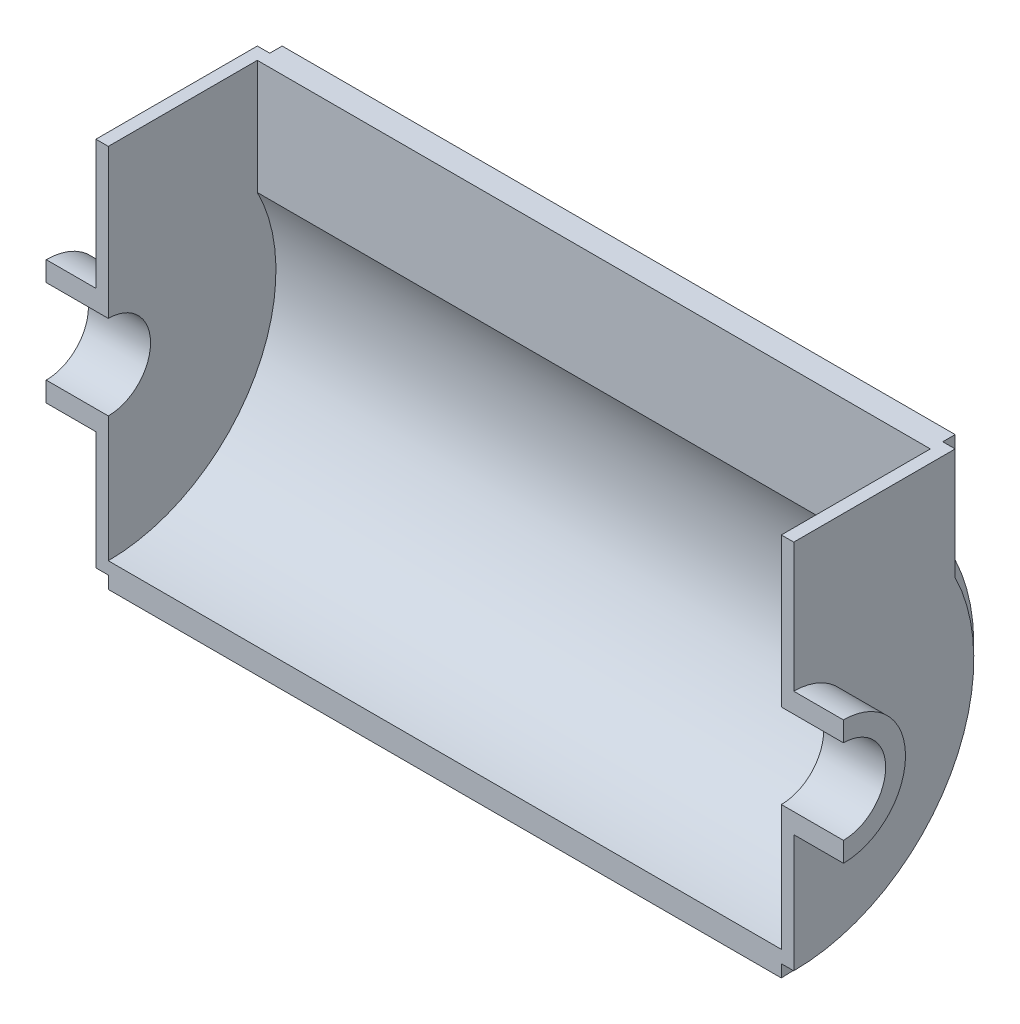
ISO-10303-21;
HEADER;
FILE_DESCRIPTION(('STEP AP214'),'2;1');
FILE_NAME('part.step','',(''),(''),'','','');
FILE_SCHEMA(('AUTOMOTIVE_DESIGN { 1 0 10303 214 1 1 1 1 }'));
ENDSEC;
DATA;
#1=APPLICATION_CONTEXT('core data for automotive mechanical design processes');
#2=APPLICATION_PROTOCOL_DEFINITION('international standard','automotive_design',2000,#1);
#3=PRODUCT_CONTEXT('',#1,'mechanical');
#4=PRODUCT('Part','Part','',(#3));
#5=PRODUCT_RELATED_PRODUCT_CATEGORY('part','',(#4));
#6=PRODUCT_DEFINITION_FORMATION('','',#4);
#7=PRODUCT_DEFINITION_CONTEXT('part definition',#1,'design');
#8=PRODUCT_DEFINITION('design','',#6,#7);
#9=PRODUCT_DEFINITION_SHAPE('','',#8);
#10=(LENGTH_UNIT() NAMED_UNIT(*) SI_UNIT(.MILLI.,.METRE.));
#11=(NAMED_UNIT(*) PLANE_ANGLE_UNIT() SI_UNIT($,.RADIAN.));
#12=(NAMED_UNIT(*) SI_UNIT($,.STERADIAN.) SOLID_ANGLE_UNIT());
#13=UNCERTAINTY_MEASURE_WITH_UNIT(LENGTH_MEASURE(1.E-05),#10,'distance_accuracy_value','');
#14=(GEOMETRIC_REPRESENTATION_CONTEXT(3) GLOBAL_UNCERTAINTY_ASSIGNED_CONTEXT((#13)) GLOBAL_UNIT_ASSIGNED_CONTEXT((#10,
#11,#12)) REPRESENTATION_CONTEXT('',''));
#15=CARTESIAN_POINT('',(0.,0.,0.));
#16=DIRECTION('',(0.,0.,1.));
#17=DIRECTION('',(1.,0.,0.));
#18=AXIS2_PLACEMENT_3D('',#15,#16,#17);
#19=CARTESIAN_POINT('',(25.,0.,0.));
#20=DIRECTION('',(1.,0.,0.));
#21=DIRECTION('',(0.,0.,-1.));
#22=AXIS2_PLACEMENT_3D('',#19,#20,#21);
#23=PLANE('',#22);
#24=DIRECTION('',(0.,-1.,0.));
#25=VECTOR('',#24,1.);
#26=CARTESIAN_POINT('',(25.,-17.,-1.78065548281E-13));
#27=LINE('',#26,#25);
#28=CARTESIAN_POINT('',(25.,-17.,-1.78065548281E-13));
#29=VERTEX_POINT('',#28);
#30=CARTESIAN_POINT('',(25.,-67.5,0.));
#31=VERTEX_POINT('',#30);
#32=EDGE_CURVE('E315',#29,#31,#27,.T.);
#33=ORIENTED_EDGE('',*,*,#32,.T.);
#34=CARTESIAN_POINT('',(25.,0.,0.));
#35=DIRECTION('',(1.,0.,0.));
#36=DIRECTION('',(0.,0.,-1.));
#37=AXIS2_PLACEMENT_3D('',#34,#35,#36);
#38=CIRCLE('',#37,67.5);
#39=CARTESIAN_POINT('',(25.,30.9232921921324,-60.));
#40=VERTEX_POINT('',#39);
#41=EDGE_CURVE('E283',#31,#40,#38,.T.);
#42=ORIENTED_EDGE('',*,*,#41,.T.);
#43=DIRECTION('',(0.,1.,0.));
#44=VECTOR('',#43,1.);
#45=CARTESIAN_POINT('',(25.,30.9232921921324,-60.));
#46=LINE('',#45,#44);
#47=CARTESIAN_POINT('',(25.,77.,-60.));
#48=VERTEX_POINT('',#47);
#49=EDGE_CURVE('E280',#40,#48,#46,.T.);
#50=ORIENTED_EDGE('',*,*,#49,.T.);
#51=DIRECTION('',(0.,0.,1.));
#52=VECTOR('',#51,1.);
#53=CARTESIAN_POINT('',(25.,77.,0.));
#54=LINE('',#53,#52);
#55=CARTESIAN_POINT('',(25.,77.,0.));
#56=VERTEX_POINT('',#55);
#57=EDGE_CURVE('E307',#48,#56,#54,.T.);
#58=ORIENTED_EDGE('',*,*,#57,.T.);
#59=DIRECTION('',(0.,-1.,0.));
#60=VECTOR('',#59,1.);
#61=CARTESIAN_POINT('',(25.,17.,0.));
#62=LINE('',#61,#60);
#63=CARTESIAN_POINT('',(25.,17.,0.));
#64=VERTEX_POINT('',#63);
#65=EDGE_CURVE('E309',#56,#64,#62,.T.);
#66=ORIENTED_EDGE('',*,*,#65,.T.);
#67=CARTESIAN_POINT('',(25.,0.,0.));
#68=DIRECTION('',(-1.,0.,0.));
#69=DIRECTION('',(0.,0.,-1.));
#70=AXIS2_PLACEMENT_3D('',#67,#68,#69);
#71=CIRCLE('',#70,17.);
#72=EDGE_CURVE('E312',#64,#29,#71,.T.);
#73=ORIENTED_EDGE('',*,*,#72,.T.);
#74=EDGE_LOOP('',(#33,#42,#50,#58,#66,#73));
#75=FACE_BOUND('',#74,.T.);
#76=ADVANCED_FACE('F38',(#75),#23,.T.);
#77=CARTESIAN_POINT('',(20.,0.,0.));
#78=DIRECTION('',(-1.,0.,0.));
#79=DIRECTION('',(0.,0.,1.));
#80=AXIS2_PLACEMENT_3D('',#77,#78,#79);
#81=CYLINDRICAL_SURFACE('',#80,25.);
#82=CARTESIAN_POINT('',(0.,0.,0.));
#83=DIRECTION('',(1.,0.,0.));
#84=DIRECTION('',(0.,0.,-1.));
#85=AXIS2_PLACEMENT_3D('',#82,#83,#84);
#86=CIRCLE('',#85,25.);
#87=CARTESIAN_POINT('',(0.,-25.,0.));
#88=VERTEX_POINT('',#87);
#89=CARTESIAN_POINT('',(0.,25.,0.));
#90=VERTEX_POINT('',#89);
#91=EDGE_CURVE('E340',#88,#90,#86,.T.);
#92=ORIENTED_EDGE('',*,*,#91,.T.);
#93=DIRECTION('',(-1.,0.,0.));
#94=VECTOR('',#93,1.);
#95=CARTESIAN_POINT('',(20.,25.,0.));
#96=LINE('',#95,#94);
#97=CARTESIAN_POINT('',(20.,25.,0.));
#98=VERTEX_POINT('',#97);
#99=EDGE_CURVE('E11',#98,#90,#96,.T.);
#100=ORIENTED_EDGE('',*,*,#99,.F.);
#101=CARTESIAN_POINT('',(20.,0.,0.));
#102=DIRECTION('',(1.,0.,0.));
#103=DIRECTION('',(0.,0.,-1.));
#104=AXIS2_PLACEMENT_3D('',#101,#102,#103);
#105=CIRCLE('',#104,25.);
#106=CARTESIAN_POINT('',(20.,-25.,0.));
#107=VERTEX_POINT('',#106);
#108=EDGE_CURVE('E341',#107,#98,#105,.T.);
#109=ORIENTED_EDGE('',*,*,#108,.F.);
#110=DIRECTION('',(-1.,0.,0.));
#111=VECTOR('',#110,1.);
#112=CARTESIAN_POINT('',(20.,-25.,0.));
#113=LINE('',#112,#111);
#114=EDGE_CURVE('E344',#107,#88,#113,.T.);
#115=ORIENTED_EDGE('',*,*,#114,.T.);
#116=EDGE_LOOP('',(#92,#100,#109,#115));
#117=FACE_BOUND('',#116,.T.);
#118=ADVANCED_FACE('F40',(#117),#81,.T.);
#119=CARTESIAN_POINT('',(20.,25.,0.));
#120=DIRECTION('',(0.,0.,-1.));
#121=DIRECTION('',(-1.,0.,0.));
#122=AXIS2_PLACEMENT_3D('',#119,#120,#121);
#123=PLANE('',#122);
#124=DIRECTION('',(0.,-1.,0.));
#125=VECTOR('',#124,1.);
#126=CARTESIAN_POINT('',(0.,25.,0.));
#127=LINE('',#126,#125);
#128=CARTESIAN_POINT('',(0.,17.,0.));
#129=VERTEX_POINT('',#128);
#130=EDGE_CURVE('E348',#90,#129,#127,.T.);
#131=ORIENTED_EDGE('',*,*,#130,.T.);
#132=DIRECTION('',(-1.,0.,0.));
#133=VECTOR('',#132,1.);
#134=CARTESIAN_POINT('',(20.,17.,0.));
#135=LINE('',#134,#133);
#136=EDGE_CURVE('E46',#64,#129,#135,.T.);
#137=ORIENTED_EDGE('',*,*,#136,.F.);
#138=ORIENTED_EDGE('',*,*,#65,.F.);
#139=DIRECTION('',(-1.,0.,0.));
#140=VECTOR('',#139,1.);
#141=CARTESIAN_POINT('',(25.,77.,0.));
#142=LINE('',#141,#140);
#143=CARTESIAN_POINT('',(20.,77.,0.));
#144=VERTEX_POINT('',#143);
#145=EDGE_CURVE('E331',#56,#144,#142,.T.);
#146=ORIENTED_EDGE('',*,*,#145,.T.);
#147=DIRECTION('',(0.,-1.,0.));
#148=VECTOR('',#147,1.);
#149=CARTESIAN_POINT('',(20.,17.,0.));
#150=LINE('',#149,#148);
#151=EDGE_CURVE('E325',#144,#98,#150,.T.);
#152=ORIENTED_EDGE('',*,*,#151,.T.);
#153=ORIENTED_EDGE('',*,*,#99,.T.);
#154=EDGE_LOOP('',(#131,#137,#138,#146,#152,#153));
#155=FACE_BOUND('',#154,.T.);
#156=ADVANCED_FACE('F394',(#155),#123,.F.);
#157=CARTESIAN_POINT('',(20.,0.,0.));
#158=DIRECTION('',(-1.,0.,0.));
#159=DIRECTION('',(0.,0.,1.));
#160=AXIS2_PLACEMENT_3D('',#157,#158,#159);
#161=CYLINDRICAL_SURFACE('',#160,17.);
#162=CARTESIAN_POINT('',(0.,0.,0.));
#163=DIRECTION('',(-1.,0.,0.));
#164=DIRECTION('',(0.,0.,-1.));
#165=AXIS2_PLACEMENT_3D('',#162,#163,#164);
#166=CIRCLE('',#165,17.);
#167=CARTESIAN_POINT('',(0.,-17.,0.));
#168=VERTEX_POINT('',#167);
#169=EDGE_CURVE('E350',#129,#168,#166,.T.);
#170=ORIENTED_EDGE('',*,*,#169,.T.);
#171=DIRECTION('',(-1.,0.,0.));
#172=VECTOR('',#171,1.);
#173=CARTESIAN_POINT('',(20.,-17.,0.));
#174=LINE('',#173,#172);
#175=EDGE_CURVE('E355',#29,#168,#174,.T.);
#176=ORIENTED_EDGE('',*,*,#175,.F.);
#177=ORIENTED_EDGE('',*,*,#72,.F.);
#178=ORIENTED_EDGE('',*,*,#136,.T.);
#179=EDGE_LOOP('',(#170,#176,#177,#178));
#180=FACE_BOUND('',#179,.T.);
#181=ADVANCED_FACE('F361',(#180),#161,.F.);
#182=CARTESIAN_POINT('',(20.,-17.,0.));
#183=DIRECTION('',(0.,0.,-1.));
#184=DIRECTION('',(-1.,0.,0.));
#185=AXIS2_PLACEMENT_3D('',#182,#183,#184);
#186=PLANE('',#185);
#187=DIRECTION('',(0.,-1.,0.));
#188=VECTOR('',#187,1.);
#189=CARTESIAN_POINT('',(0.,-17.,0.));
#190=LINE('',#189,#188);
#191=EDGE_CURVE('E345',#168,#88,#190,.T.);
#192=ORIENTED_EDGE('',*,*,#191,.T.);
#193=ORIENTED_EDGE('',*,*,#114,.F.);
#194=DIRECTION('',(0.,-1.,0.));
#195=VECTOR('',#194,1.);
#196=CARTESIAN_POINT('',(20.,-17.,-1.78065548281E-13));
#197=LINE('',#196,#195);
#198=CARTESIAN_POINT('',(20.,-72.5,0.));
#199=VERTEX_POINT('',#198);
#200=EDGE_CURVE('E305',#107,#199,#197,.T.);
#201=ORIENTED_EDGE('',*,*,#200,.T.);
#202=DIRECTION('',(-1.,0.,0.));
#203=VECTOR('',#202,1.);
#204=CARTESIAN_POINT('',(25.,-72.5,0.));
#205=LINE('',#204,#203);
#206=CARTESIAN_POINT('',(25.,-72.5,0.));
#207=VERTEX_POINT('',#206);
#208=EDGE_CURVE('E318',#207,#199,#205,.T.);
#209=ORIENTED_EDGE('',*,*,#208,.F.);
#210=DIRECTION('',(0.,1.,0.));
#211=VECTOR('',#210,1.);
#212=CARTESIAN_POINT('',(25.,-77.5,0.));
#213=LINE('',#212,#211);
#214=CARTESIAN_POINT('',(25.,-77.5,0.));
#215=VERTEX_POINT('',#214);
#216=EDGE_CURVE('E286',#215,#207,#213,.T.);
#217=ORIENTED_EDGE('',*,*,#216,.F.);
#218=DIRECTION('',(-1.,0.,0.));
#219=VECTOR('',#218,1.);
#220=CARTESIAN_POINT('',(296.,-77.5,0.));
#221=LINE('',#220,#219);
#222=CARTESIAN_POINT('',(296.,-77.5,0.));
#223=VERTEX_POINT('',#222);
#224=EDGE_CURVE('E291',#223,#215,#221,.T.);
#225=ORIENTED_EDGE('',*,*,#224,.F.);
#226=DIRECTION('',(0.,1.,0.));
#227=VECTOR('',#226,1.);
#228=CARTESIAN_POINT('',(296.,-77.5,0.));
#229=LINE('',#228,#227);
#230=CARTESIAN_POINT('',(296.,-72.5,0.));
#231=VERTEX_POINT('',#230);
#232=EDGE_CURVE('E271',#223,#231,#229,.T.);
#233=ORIENTED_EDGE('',*,*,#232,.T.);
#234=DIRECTION('',(1.,0.,0.));
#235=VECTOR('',#234,1.);
#236=CARTESIAN_POINT('',(296.,-72.5,0.));
#237=LINE('',#236,#235);
#238=CARTESIAN_POINT('',(301.,-72.5,0.));
#239=VERTEX_POINT('',#238);
#240=EDGE_CURVE('E222',#231,#239,#237,.T.);
#241=ORIENTED_EDGE('',*,*,#240,.T.);
#242=DIRECTION('',(0.,-1.,0.));
#243=VECTOR('',#242,1.);
#244=CARTESIAN_POINT('',(301.,-17.,-1.78065548281E-13));
#245=LINE('',#244,#243);
#246=CARTESIAN_POINT('',(301.,-25.,0.));
#247=VERTEX_POINT('',#246);
#248=EDGE_CURVE('E211',#247,#239,#245,.T.);
#249=ORIENTED_EDGE('',*,*,#248,.F.);
#250=DIRECTION('',(1.,0.,0.));
#251=VECTOR('',#250,1.);
#252=CARTESIAN_POINT('',(301.,-25.,0.));
#253=LINE('',#252,#251);
#254=CARTESIAN_POINT('',(321.,-25.,0.));
#255=VERTEX_POINT('',#254);
#256=EDGE_CURVE('E241',#247,#255,#253,.T.);
#257=ORIENTED_EDGE('',*,*,#256,.T.);
#258=DIRECTION('',(0.,-1.,0.));
#259=VECTOR('',#258,1.);
#260=CARTESIAN_POINT('',(321.,-17.,0.));
#261=LINE('',#260,#259);
#262=CARTESIAN_POINT('',(321.,-17.,0.));
#263=VERTEX_POINT('',#262);
#264=EDGE_CURVE('E242',#263,#255,#261,.T.);
#265=ORIENTED_EDGE('',*,*,#264,.F.);
#266=DIRECTION('',(1.,0.,0.));
#267=VECTOR('',#266,1.);
#268=CARTESIAN_POINT('',(301.,-17.,0.));
#269=LINE('',#268,#267);
#270=CARTESIAN_POINT('',(296.,-17.,-1.78065548281E-13));
#271=VERTEX_POINT('',#270);
#272=EDGE_CURVE('E254',#271,#263,#269,.T.);
#273=ORIENTED_EDGE('',*,*,#272,.F.);
#274=DIRECTION('',(0.,-1.,0.));
#275=VECTOR('',#274,1.);
#276=CARTESIAN_POINT('',(296.,-17.,-1.78065548281E-13));
#277=LINE('',#276,#275);
#278=CARTESIAN_POINT('',(296.,-67.5,0.));
#279=VERTEX_POINT('',#278);
#280=EDGE_CURVE('E219',#271,#279,#277,.T.);
#281=ORIENTED_EDGE('',*,*,#280,.T.);
#282=DIRECTION('',(-1.,0.,0.));
#283=VECTOR('',#282,1.);
#284=CARTESIAN_POINT('',(296.,-67.5,0.));
#285=LINE('',#284,#283);
#286=EDGE_CURVE('E293',#279,#31,#285,.T.);
#287=ORIENTED_EDGE('',*,*,#286,.T.);
#288=ORIENTED_EDGE('',*,*,#32,.F.);
#289=ORIENTED_EDGE('',*,*,#175,.T.);
#290=EDGE_LOOP('',(#192,#193,#201,#209,#217,#225,#233,#241,#249,#257,#265,#273,#281,#287,#288,#289));
#291=FACE_BOUND('',#290,.T.);
#292=ADVANCED_FACE('F369',(#291),#186,.F.);
#293=CARTESIAN_POINT('',(0.,0.,0.));
#294=DIRECTION('',(1.,0.,0.));
#295=DIRECTION('',(0.,0.,-1.));
#296=AXIS2_PLACEMENT_3D('',#293,#294,#295);
#297=PLANE('',#296);
#298=ORIENTED_EDGE('',*,*,#91,.F.);
#299=ORIENTED_EDGE('',*,*,#191,.F.);
#300=ORIENTED_EDGE('',*,*,#169,.F.);
#301=ORIENTED_EDGE('',*,*,#130,.F.);
#302=EDGE_LOOP('',(#298,#299,#300,#301));
#303=FACE_BOUND('',#302,.T.);
#304=ADVANCED_FACE('F367',(#303),#297,.F.);
#305=CARTESIAN_POINT('',(25.,0.,0.));
#306=DIRECTION('',(-1.,0.,0.));
#307=DIRECTION('',(0.,0.,1.));
#308=AXIS2_PLACEMENT_3D('',#305,#306,#307);
#309=CYLINDRICAL_SURFACE('',#308,72.5);
#310=CARTESIAN_POINT('',(20.,0.,0.));
#311=DIRECTION('',(1.,0.,0.));
#312=DIRECTION('',(0.,0.,-1.));
#313=AXIS2_PLACEMENT_3D('',#310,#311,#312);
#314=CIRCLE('',#313,72.5);
#315=CARTESIAN_POINT('',(20.,32.1130814466628,-65.));
#316=VERTEX_POINT('',#315);
#317=EDGE_CURVE('E301',#199,#316,#314,.T.);
#318=ORIENTED_EDGE('',*,*,#317,.T.);
#319=DIRECTION('',(-1.,0.,0.));
#320=VECTOR('',#319,1.);
#321=CARTESIAN_POINT('',(25.,32.1130814466628,-65.));
#322=LINE('',#321,#320);
#323=CARTESIAN_POINT('',(25.,32.1130814466628,-65.));
#324=VERTEX_POINT('',#323);
#325=EDGE_CURVE('E337',#324,#316,#322,.T.);
#326=ORIENTED_EDGE('',*,*,#325,.F.);
#327=CARTESIAN_POINT('',(25.,0.,0.));
#328=DIRECTION('',(1.,0.,0.));
#329=DIRECTION('',(0.,0.,-1.));
#330=AXIS2_PLACEMENT_3D('',#327,#328,#329);
#331=CIRCLE('',#330,72.5);
#332=EDGE_CURVE('E302',#207,#324,#331,.T.);
#333=ORIENTED_EDGE('',*,*,#332,.F.);
#334=ORIENTED_EDGE('',*,*,#208,.T.);
#335=EDGE_LOOP('',(#318,#326,#333,#334));
#336=FACE_BOUND('',#335,.T.);
#337=ADVANCED_FACE('F382',(#336),#309,.T.);
#338=CARTESIAN_POINT('',(25.,77.,-65.));
#339=DIRECTION('',(0.,0.,1.));
#340=DIRECTION('',(0.,-1.,0.));
#341=AXIS2_PLACEMENT_3D('',#338,#339,#340);
#342=PLANE('',#341);
#343=DIRECTION('',(0.,1.,0.));
#344=VECTOR('',#343,1.);
#345=CARTESIAN_POINT('',(20.,77.,-65.));
#346=LINE('',#345,#344);
#347=CARTESIAN_POINT('',(20.,77.,-65.));
#348=VERTEX_POINT('',#347);
#349=EDGE_CURVE('E321',#316,#348,#346,.T.);
#350=ORIENTED_EDGE('',*,*,#349,.T.);
#351=DIRECTION('',(-1.,0.,0.));
#352=VECTOR('',#351,1.);
#353=CARTESIAN_POINT('',(25.,77.,-65.));
#354=LINE('',#353,#352);
#355=CARTESIAN_POINT('',(25.,77.,-65.));
#356=VERTEX_POINT('',#355);
#357=EDGE_CURVE('E334',#356,#348,#354,.T.);
#358=ORIENTED_EDGE('',*,*,#357,.F.);
#359=DIRECTION('',(0.,1.,0.));
#360=VECTOR('',#359,1.);
#361=CARTESIAN_POINT('',(25.,77.,-65.));
#362=LINE('',#361,#360);
#363=EDGE_CURVE('E304',#324,#356,#362,.T.);
#364=ORIENTED_EDGE('',*,*,#363,.F.);
#365=ORIENTED_EDGE('',*,*,#325,.T.);
#366=EDGE_LOOP('',(#350,#358,#364,#365));
#367=FACE_BOUND('',#366,.T.);
#368=ADVANCED_FACE('F391',(#367),#342,.F.);
#369=CARTESIAN_POINT('',(25.,77.,0.));
#370=DIRECTION('',(0.,-1.,0.));
#371=DIRECTION('',(0.,0.,-1.));
#372=AXIS2_PLACEMENT_3D('',#369,#370,#371);
#373=PLANE('',#372);
#374=DIRECTION('',(0.,0.,1.));
#375=VECTOR('',#374,1.);
#376=CARTESIAN_POINT('',(20.,77.,0.));
#377=LINE('',#376,#375);
#378=EDGE_CURVE('E323',#348,#144,#377,.T.);
#379=ORIENTED_EDGE('',*,*,#378,.T.);
#380=ORIENTED_EDGE('',*,*,#145,.F.);
#381=ORIENTED_EDGE('',*,*,#57,.F.);
#382=DIRECTION('',(-1.,0.,0.));
#383=VECTOR('',#382,1.);
#384=CARTESIAN_POINT('',(296.,77.,-60.));
#385=LINE('',#384,#383);
#386=CARTESIAN_POINT('',(296.,77.,-60.));
#387=VERTEX_POINT('',#386);
#388=EDGE_CURVE('E297',#387,#48,#385,.T.);
#389=ORIENTED_EDGE('',*,*,#388,.F.);
#390=DIRECTION('',(0.,0.,1.));
#391=VECTOR('',#390,1.);
#392=CARTESIAN_POINT('',(296.,77.,0.));
#393=LINE('',#392,#391);
#394=CARTESIAN_POINT('',(296.,77.,0.));
#395=VERTEX_POINT('',#394);
#396=EDGE_CURVE('E207',#387,#395,#393,.T.);
#397=ORIENTED_EDGE('',*,*,#396,.T.);
#398=DIRECTION('',(1.,0.,0.));
#399=VECTOR('',#398,1.);
#400=CARTESIAN_POINT('',(296.,77.,0.));
#401=LINE('',#400,#399);
#402=CARTESIAN_POINT('',(301.,77.,0.));
#403=VERTEX_POINT('',#402);
#404=EDGE_CURVE('E203',#395,#403,#401,.T.);
#405=ORIENTED_EDGE('',*,*,#404,.T.);
#406=DIRECTION('',(0.,0.,1.));
#407=VECTOR('',#406,1.);
#408=CARTESIAN_POINT('',(301.,77.,0.));
#409=LINE('',#408,#407);
#410=CARTESIAN_POINT('',(301.,77.,-65.));
#411=VERTEX_POINT('',#410);
#412=EDGE_CURVE('E199',#411,#403,#409,.T.);
#413=ORIENTED_EDGE('',*,*,#412,.F.);
#414=DIRECTION('',(1.,0.,0.));
#415=VECTOR('',#414,1.);
#416=CARTESIAN_POINT('',(296.,77.,-65.));
#417=LINE('',#416,#415);
#418=CARTESIAN_POINT('',(296.,77.,-65.));
#419=VERTEX_POINT('',#418);
#420=EDGE_CURVE('E196',#419,#411,#417,.T.);
#421=ORIENTED_EDGE('',*,*,#420,.F.);
#422=DIRECTION('',(0.,0.,-1.));
#423=VECTOR('',#422,1.);
#424=CARTESIAN_POINT('',(296.,77.,-60.));
#425=LINE('',#424,#423);
#426=CARTESIAN_POINT('',(296.,77.,-70.));
#427=VERTEX_POINT('',#426);
#428=EDGE_CURVE('E185',#419,#427,#425,.T.);
#429=ORIENTED_EDGE('',*,*,#428,.T.);
#430=DIRECTION('',(-1.,0.,0.));
#431=VECTOR('',#430,1.);
#432=CARTESIAN_POINT('',(296.,77.,-70.));
#433=LINE('',#432,#431);
#434=CARTESIAN_POINT('',(25.,77.,-70.));
#435=VERTEX_POINT('',#434);
#436=EDGE_CURVE('E299',#427,#435,#433,.T.);
#437=ORIENTED_EDGE('',*,*,#436,.T.);
#438=DIRECTION('',(0.,0.,-1.));
#439=VECTOR('',#438,1.);
#440=CARTESIAN_POINT('',(25.,77.,-60.));
#441=LINE('',#440,#439);
#442=EDGE_CURVE('E278',#356,#435,#441,.T.);
#443=ORIENTED_EDGE('',*,*,#442,.F.);
#444=ORIENTED_EDGE('',*,*,#357,.T.);
#445=EDGE_LOOP('',(#379,#380,#381,#389,#397,#405,#413,#421,#429,#437,#443,#444));
#446=FACE_BOUND('',#445,.T.);
#447=ADVANCED_FACE('F197',(#446),#373,.F.);
#448=CARTESIAN_POINT('',(20.,0.,0.));
#449=DIRECTION('',(1.,0.,0.));
#450=DIRECTION('',(0.,0.,-1.));
#451=AXIS2_PLACEMENT_3D('',#448,#449,#450);
#452=PLANE('',#451);
#453=ORIENTED_EDGE('',*,*,#200,.F.);
#454=ORIENTED_EDGE('',*,*,#108,.T.);
#455=ORIENTED_EDGE('',*,*,#151,.F.);
#456=ORIENTED_EDGE('',*,*,#378,.F.);
#457=ORIENTED_EDGE('',*,*,#349,.F.);
#458=ORIENTED_EDGE('',*,*,#317,.F.);
#459=EDGE_LOOP('',(#453,#454,#455,#456,#457,#458));
#460=FACE_BOUND('',#459,.T.);
#461=ADVANCED_FACE('F377',(#460),#452,.F.);
#462=CARTESIAN_POINT('',(25.,0.,0.));
#463=DIRECTION('',(1.,0.,0.));
#464=DIRECTION('',(0.,0.,-1.));
#465=AXIS2_PLACEMENT_3D('',#462,#463,#464);
#466=PLANE('',#465);
#467=ORIENTED_EDGE('',*,*,#216,.T.);
#468=ORIENTED_EDGE('',*,*,#332,.T.);
#469=ORIENTED_EDGE('',*,*,#363,.T.);
#470=ORIENTED_EDGE('',*,*,#442,.T.);
#471=DIRECTION('',(0.,1.,0.));
#472=VECTOR('',#471,1.);
#473=CARTESIAN_POINT('',(25.,30.9232921921324,-70.));
#474=LINE('',#473,#472);
#475=CARTESIAN_POINT('',(25.,33.2603367391252,-70.));
#476=VERTEX_POINT('',#475);
#477=EDGE_CURVE('E263',#476,#435,#474,.T.);
#478=ORIENTED_EDGE('',*,*,#477,.F.);
#479=CARTESIAN_POINT('',(25.,0.,0.));
#480=DIRECTION('',(1.,0.,0.));
#481=DIRECTION('',(0.,0.,-1.));
#482=AXIS2_PLACEMENT_3D('',#479,#480,#481);
#483=CIRCLE('',#482,77.5);
#484=EDGE_CURVE('E264',#215,#476,#483,.T.);
#485=ORIENTED_EDGE('',*,*,#484,.F.);
#486=EDGE_LOOP('',(#467,#468,#469,#470,#478,#485));
#487=FACE_BOUND('',#486,.T.);
#488=ADVANCED_FACE('F386',(#487),#466,.F.);
#489=CARTESIAN_POINT('',(296.,30.9232921921324,-70.));
#490=DIRECTION('',(0.,0.,1.));
#491=DIRECTION('',(1.,0.,0.));
#492=AXIS2_PLACEMENT_3D('',#489,#490,#491);
#493=PLANE('',#492);
#494=ORIENTED_EDGE('',*,*,#477,.T.);
#495=ORIENTED_EDGE('',*,*,#436,.F.);
#496=DIRECTION('',(0.,1.,0.));
#497=VECTOR('',#496,1.);
#498=CARTESIAN_POINT('',(296.,30.9232921921324,-70.));
#499=LINE('',#498,#497);
#500=CARTESIAN_POINT('',(296.,33.2603367391252,-70.));
#501=VERTEX_POINT('',#500);
#502=EDGE_CURVE('E189',#501,#427,#499,.T.);
#503=ORIENTED_EDGE('',*,*,#502,.F.);
#504=DIRECTION('',(-1.,0.,0.));
#505=VECTOR('',#504,1.);
#506=CARTESIAN_POINT('',(296.,33.2603367391252,-70.));
#507=LINE('',#506,#505);
#508=EDGE_CURVE('E275',#501,#476,#507,.T.);
#509=ORIENTED_EDGE('',*,*,#508,.T.);
#510=EDGE_LOOP('',(#494,#495,#503,#509));
#511=FACE_BOUND('',#510,.T.);
#512=ADVANCED_FACE('F425',(#511),#493,.F.);
#513=CARTESIAN_POINT('',(296.,30.9232921921324,-60.));
#514=DIRECTION('',(0.,0.,1.));
#515=DIRECTION('',(1.,0.,0.));
#516=AXIS2_PLACEMENT_3D('',#513,#514,#515);
#517=PLANE('',#516);
#518=ORIENTED_EDGE('',*,*,#49,.F.);
#519=DIRECTION('',(-1.,0.,0.));
#520=VECTOR('',#519,1.);
#521=CARTESIAN_POINT('',(296.,30.9232921921324,-60.));
#522=LINE('',#521,#520);
#523=CARTESIAN_POINT('',(296.,30.9232921921324,-60.));
#524=VERTEX_POINT('',#523);
#525=EDGE_CURVE('E295',#524,#40,#522,.T.);
#526=ORIENTED_EDGE('',*,*,#525,.F.);
#527=DIRECTION('',(0.,1.,0.));
#528=VECTOR('',#527,1.);
#529=CARTESIAN_POINT('',(296.,30.9232921921324,-60.));
#530=LINE('',#529,#528);
#531=EDGE_CURVE('E193',#524,#387,#530,.T.);
#532=ORIENTED_EDGE('',*,*,#531,.T.);
#533=ORIENTED_EDGE('',*,*,#388,.T.);
#534=EDGE_LOOP('',(#518,#526,#532,#533));
#535=FACE_BOUND('',#534,.T.);
#536=ADVANCED_FACE('F400',(#535),#517,.T.);
#537=CARTESIAN_POINT('',(296.,0.,0.));
#538=DIRECTION('',(-1.,0.,0.));
#539=DIRECTION('',(0.,0.,1.));
#540=AXIS2_PLACEMENT_3D('',#537,#538,#539);
#541=CYLINDRICAL_SURFACE('',#540,67.5);
#542=ORIENTED_EDGE('',*,*,#41,.F.);
#543=ORIENTED_EDGE('',*,*,#286,.F.);
#544=CARTESIAN_POINT('',(296.,0.,0.));
#545=DIRECTION('',(1.,0.,0.));
#546=DIRECTION('',(0.,0.,-1.));
#547=AXIS2_PLACEMENT_3D('',#544,#545,#546);
#548=CIRCLE('',#547,67.5);
#549=EDGE_CURVE('E268',#279,#524,#548,.T.);
#550=ORIENTED_EDGE('',*,*,#549,.T.);
#551=ORIENTED_EDGE('',*,*,#525,.T.);
#552=EDGE_LOOP('',(#542,#543,#550,#551));
#553=FACE_BOUND('',#552,.T.);
#554=ADVANCED_FACE('F432',(#553),#541,.F.);
#555=CARTESIAN_POINT('',(296.,0.,0.));
#556=DIRECTION('',(-1.,0.,0.));
#557=DIRECTION('',(0.,0.,1.));
#558=AXIS2_PLACEMENT_3D('',#555,#556,#557);
#559=CYLINDRICAL_SURFACE('',#558,77.5);
#560=ORIENTED_EDGE('',*,*,#484,.T.);
#561=ORIENTED_EDGE('',*,*,#508,.F.);
#562=CARTESIAN_POINT('',(296.,0.,0.));
#563=DIRECTION('',(1.,0.,0.));
#564=DIRECTION('',(0.,0.,-1.));
#565=AXIS2_PLACEMENT_3D('',#562,#563,#564);
#566=CIRCLE('',#565,77.5);
#567=EDGE_CURVE('E273',#223,#501,#566,.T.);
#568=ORIENTED_EDGE('',*,*,#567,.F.);
#569=ORIENTED_EDGE('',*,*,#224,.T.);
#570=EDGE_LOOP('',(#560,#561,#568,#569));
#571=FACE_BOUND('',#570,.T.);
#572=ADVANCED_FACE('F422',(#571),#559,.T.);
#573=CARTESIAN_POINT('',(296.,0.,0.));
#574=DIRECTION('',(1.,0.,0.));
#575=DIRECTION('',(0.,0.,-1.));
#576=AXIS2_PLACEMENT_3D('',#573,#574,#575);
#577=PLANE('',#576);
#578=CARTESIAN_POINT('',(296.,0.,0.));
#579=DIRECTION('',(1.,0.,0.));
#580=DIRECTION('',(0.,0.,-1.));
#581=AXIS2_PLACEMENT_3D('',#578,#579,#580);
#582=CIRCLE('',#581,72.5);
#583=CARTESIAN_POINT('',(296.,32.1130814466628,-65.));
#584=VERTEX_POINT('',#583);
#585=EDGE_CURVE('E58',#231,#584,#582,.T.);
#586=ORIENTED_EDGE('',*,*,#585,.F.);
#587=ORIENTED_EDGE('',*,*,#232,.F.);
#588=ORIENTED_EDGE('',*,*,#567,.T.);
#589=ORIENTED_EDGE('',*,*,#502,.T.);
#590=ORIENTED_EDGE('',*,*,#428,.F.);
#591=DIRECTION('',(0.,1.,0.));
#592=VECTOR('',#591,1.);
#593=CARTESIAN_POINT('',(296.,77.,-65.));
#594=LINE('',#593,#592);
#595=EDGE_CURVE('E53',#584,#419,#594,.T.);
#596=ORIENTED_EDGE('',*,*,#595,.F.);
#597=EDGE_LOOP('',(#586,#587,#588,#589,#590,#596));
#598=FACE_BOUND('',#597,.T.);
#599=ADVANCED_FACE('F187',(#598),#577,.T.);
#600=CARTESIAN_POINT('',(296.,0.,0.));
#601=DIRECTION('',(-1.,0.,0.));
#602=DIRECTION('',(0.,0.,-1.));
#603=AXIS2_PLACEMENT_3D('',#600,#601,#602);
#604=PLANE('',#603);
#605=ORIENTED_EDGE('',*,*,#531,.F.);
#606=ORIENTED_EDGE('',*,*,#549,.F.);
#607=ORIENTED_EDGE('',*,*,#280,.F.);
#608=CARTESIAN_POINT('',(296.,0.,0.));
#609=DIRECTION('',(-1.,0.,0.));
#610=DIRECTION('',(0.,0.,-1.));
#611=AXIS2_PLACEMENT_3D('',#608,#609,#610);
#612=CIRCLE('',#611,17.);
#613=CARTESIAN_POINT('',(296.,17.,0.));
#614=VERTEX_POINT('',#613);
#615=EDGE_CURVE('E216',#614,#271,#612,.T.);
#616=ORIENTED_EDGE('',*,*,#615,.F.);
#617=DIRECTION('',(0.,-1.,0.));
#618=VECTOR('',#617,1.);
#619=CARTESIAN_POINT('',(296.,17.,0.));
#620=LINE('',#619,#618);
#621=EDGE_CURVE('E209',#395,#614,#620,.T.);
#622=ORIENTED_EDGE('',*,*,#621,.F.);
#623=ORIENTED_EDGE('',*,*,#396,.F.);
#624=EDGE_LOOP('',(#605,#606,#607,#616,#622,#623));
#625=FACE_BOUND('',#624,.T.);
#626=ADVANCED_FACE('F406',(#625),#604,.T.);
#627=CARTESIAN_POINT('',(301.,0.,0.));
#628=DIRECTION('',(1.,0.,0.));
#629=DIRECTION('',(0.,0.,1.));
#630=AXIS2_PLACEMENT_3D('',#627,#628,#629);
#631=CYLINDRICAL_SURFACE('',#630,25.);
#632=CARTESIAN_POINT('',(321.,0.,0.));
#633=DIRECTION('',(1.,0.,0.));
#634=DIRECTION('',(0.,0.,-1.));
#635=AXIS2_PLACEMENT_3D('',#632,#633,#634);
#636=CIRCLE('',#635,25.);
#637=CARTESIAN_POINT('',(321.,25.,0.));
#638=VERTEX_POINT('',#637);
#639=EDGE_CURVE('E237',#255,#638,#636,.T.);
#640=ORIENTED_EDGE('',*,*,#639,.F.);
#641=ORIENTED_EDGE('',*,*,#256,.F.);
#642=CARTESIAN_POINT('',(301.,0.,0.));
#643=DIRECTION('',(1.,0.,0.));
#644=DIRECTION('',(0.,0.,-1.));
#645=AXIS2_PLACEMENT_3D('',#642,#643,#644);
#646=CIRCLE('',#645,25.);
#647=CARTESIAN_POINT('',(301.,25.,0.));
#648=VERTEX_POINT('',#647);
#649=EDGE_CURVE('E238',#247,#648,#646,.T.);
#650=ORIENTED_EDGE('',*,*,#649,.T.);
#651=DIRECTION('',(1.,0.,0.));
#652=VECTOR('',#651,1.);
#653=CARTESIAN_POINT('',(301.,25.,0.));
#654=LINE('',#653,#652);
#655=EDGE_CURVE('E260',#648,#638,#654,.T.);
#656=ORIENTED_EDGE('',*,*,#655,.T.);
#657=EDGE_LOOP('',(#640,#641,#650,#656));
#658=FACE_BOUND('',#657,.T.);
#659=ADVANCED_FACE('F535',(#658),#631,.T.);
#660=CARTESIAN_POINT('',(301.,25.,0.));
#661=DIRECTION('',(0.,0.,-1.));
#662=DIRECTION('',(1.,0.,0.));
#663=AXIS2_PLACEMENT_3D('',#660,#661,#662);
#664=PLANE('',#663);
#665=DIRECTION('',(0.,-1.,0.));
#666=VECTOR('',#665,1.);
#667=CARTESIAN_POINT('',(321.,25.,0.));
#668=LINE('',#667,#666);
#669=CARTESIAN_POINT('',(321.,17.,0.));
#670=VERTEX_POINT('',#669);
#671=EDGE_CURVE('E245',#638,#670,#668,.T.);
#672=ORIENTED_EDGE('',*,*,#671,.F.);
#673=ORIENTED_EDGE('',*,*,#655,.F.);
#674=DIRECTION('',(0.,-1.,0.));
#675=VECTOR('',#674,1.);
#676=CARTESIAN_POINT('',(301.,17.,0.));
#677=LINE('',#676,#675);
#678=EDGE_CURVE('E229',#403,#648,#677,.T.);
#679=ORIENTED_EDGE('',*,*,#678,.F.);
#680=ORIENTED_EDGE('',*,*,#404,.F.);
#681=ORIENTED_EDGE('',*,*,#621,.T.);
#682=DIRECTION('',(1.,0.,0.));
#683=VECTOR('',#682,1.);
#684=CARTESIAN_POINT('',(301.,17.,0.));
#685=LINE('',#684,#683);
#686=EDGE_CURVE('E257',#614,#670,#685,.T.);
#687=ORIENTED_EDGE('',*,*,#686,.T.);
#688=EDGE_LOOP('',(#672,#673,#679,#680,#681,#687));
#689=FACE_BOUND('',#688,.T.);
#690=ADVANCED_FACE('F411',(#689),#664,.F.);
#691=CARTESIAN_POINT('',(301.,0.,0.));
#692=DIRECTION('',(1.,0.,0.));
#693=DIRECTION('',(0.,0.,1.));
#694=AXIS2_PLACEMENT_3D('',#691,#692,#693);
#695=CYLINDRICAL_SURFACE('',#694,17.);
#696=CARTESIAN_POINT('',(321.,0.,0.));
#697=DIRECTION('',(-1.,0.,0.));
#698=DIRECTION('',(0.,0.,-1.));
#699=AXIS2_PLACEMENT_3D('',#696,#697,#698);
#700=CIRCLE('',#699,17.);
#701=EDGE_CURVE('E248',#670,#263,#700,.T.);
#702=ORIENTED_EDGE('',*,*,#701,.F.);
#703=ORIENTED_EDGE('',*,*,#686,.F.);
#704=ORIENTED_EDGE('',*,*,#615,.T.);
#705=ORIENTED_EDGE('',*,*,#272,.T.);
#706=EDGE_LOOP('',(#702,#703,#704,#705));
#707=FACE_BOUND('',#706,.T.);
#708=ADVANCED_FACE('F555',(#707),#695,.F.);
#709=CARTESIAN_POINT('',(321.,0.,0.));
#710=DIRECTION('',(-1.,0.,0.));
#711=DIRECTION('',(0.,0.,-1.));
#712=AXIS2_PLACEMENT_3D('',#709,#710,#711);
#713=PLANE('',#712);
#714=ORIENTED_EDGE('',*,*,#639,.T.);
#715=ORIENTED_EDGE('',*,*,#671,.T.);
#716=ORIENTED_EDGE('',*,*,#701,.T.);
#717=ORIENTED_EDGE('',*,*,#264,.T.);
#718=EDGE_LOOP('',(#714,#715,#716,#717));
#719=FACE_BOUND('',#718,.T.);
#720=ADVANCED_FACE('F565',(#719),#713,.F.);
#721=CARTESIAN_POINT('',(296.,0.,0.));
#722=DIRECTION('',(1.,0.,0.));
#723=DIRECTION('',(0.,0.,1.));
#724=AXIS2_PLACEMENT_3D('',#721,#722,#723);
#725=CYLINDRICAL_SURFACE('',#724,72.5);
#726=CARTESIAN_POINT('',(301.,0.,0.));
#727=DIRECTION('',(1.,0.,0.));
#728=DIRECTION('',(0.,0.,-1.));
#729=AXIS2_PLACEMENT_3D('',#726,#727,#728);
#730=CIRCLE('',#729,72.5);
#731=CARTESIAN_POINT('',(301.,32.1130814466628,-65.));
#732=VERTEX_POINT('',#731);
#733=EDGE_CURVE('E223',#239,#732,#730,.T.);
#734=ORIENTED_EDGE('',*,*,#733,.F.);
#735=ORIENTED_EDGE('',*,*,#240,.F.);
#736=ORIENTED_EDGE('',*,*,#585,.T.);
#737=DIRECTION('',(1.,0.,0.));
#738=VECTOR('',#737,1.);
#739=CARTESIAN_POINT('',(296.,32.1130814466628,-65.));
#740=LINE('',#739,#738);
#741=EDGE_CURVE('E202',#584,#732,#740,.T.);
#742=ORIENTED_EDGE('',*,*,#741,.T.);
#743=EDGE_LOOP('',(#734,#735,#736,#742));
#744=FACE_BOUND('',#743,.T.);
#745=ADVANCED_FACE('F417',(#744),#725,.T.);
#746=CARTESIAN_POINT('',(296.,77.,-65.));
#747=DIRECTION('',(0.,0.,1.));
#748=DIRECTION('',(0.,-1.,0.));
#749=AXIS2_PLACEMENT_3D('',#746,#747,#748);
#750=PLANE('',#749);
#751=DIRECTION('',(0.,1.,0.));
#752=VECTOR('',#751,1.);
#753=CARTESIAN_POINT('',(301.,77.,-65.));
#754=LINE('',#753,#752);
#755=EDGE_CURVE('E226',#732,#411,#754,.T.);
#756=ORIENTED_EDGE('',*,*,#755,.F.);
#757=ORIENTED_EDGE('',*,*,#741,.F.);
#758=ORIENTED_EDGE('',*,*,#595,.T.);
#759=ORIENTED_EDGE('',*,*,#420,.T.);
#760=EDGE_LOOP('',(#756,#757,#758,#759));
#761=FACE_BOUND('',#760,.T.);
#762=ADVANCED_FACE('F205',(#761),#750,.F.);
#763=CARTESIAN_POINT('',(301.,0.,0.));
#764=DIRECTION('',(-1.,0.,0.));
#765=DIRECTION('',(0.,0.,-1.));
#766=AXIS2_PLACEMENT_3D('',#763,#764,#765);
#767=PLANE('',#766);
#768=ORIENTED_EDGE('',*,*,#248,.T.);
#769=ORIENTED_EDGE('',*,*,#733,.T.);
#770=ORIENTED_EDGE('',*,*,#755,.T.);
#771=ORIENTED_EDGE('',*,*,#412,.T.);
#772=ORIENTED_EDGE('',*,*,#678,.T.);
#773=ORIENTED_EDGE('',*,*,#649,.F.);
#774=EDGE_LOOP('',(#768,#769,#770,#771,#772,#773));
#775=FACE_BOUND('',#774,.T.);
#776=ADVANCED_FACE('F414',(#775),#767,.F.);
#777=CLOSED_SHELL('',(#76,#118,#156,#181,#292,#304,#337,#368,#447,#461,#488,#512,#536,#554,#572,
#599,#626,#659,#690,#708,#720,#745,#762,#776));
#778=MANIFOLD_SOLID_BREP('B2',#777);
#779=ADVANCED_BREP_SHAPE_REPRESENTATION('',(#18,#778),#14);
#780=SHAPE_DEFINITION_REPRESENTATION(#9,#779);
ENDSEC;
END-ISO-10303-21;
